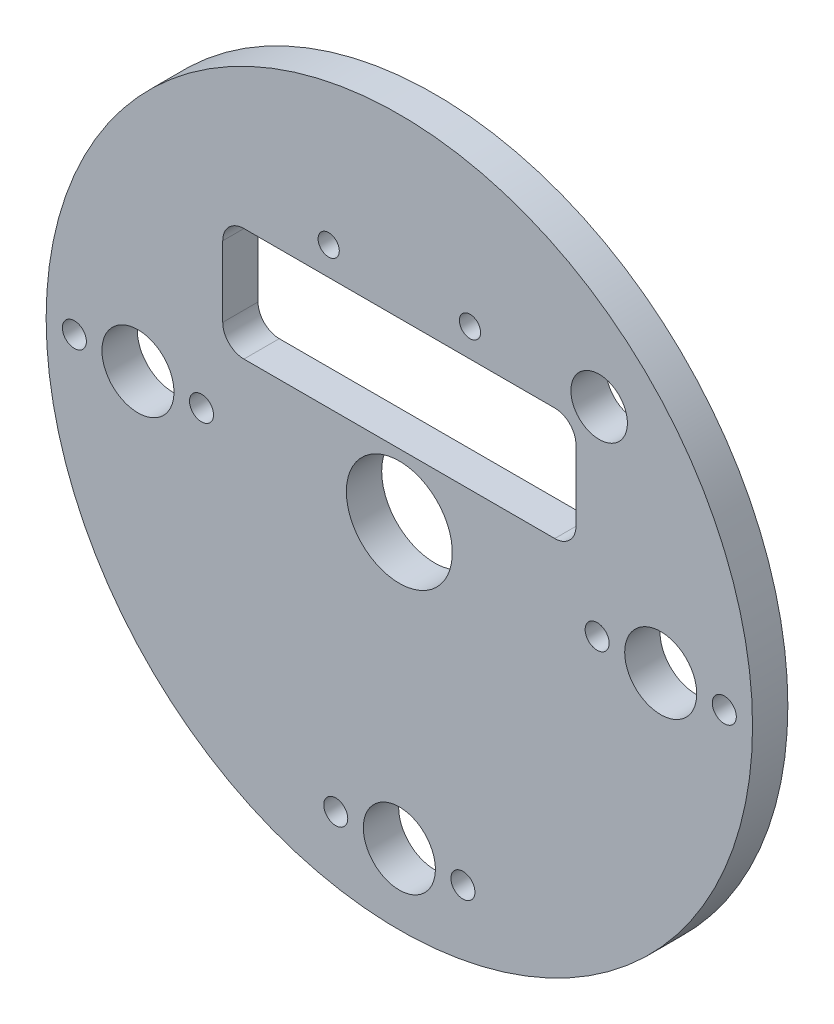
ISO-10303-21;
HEADER;
FILE_DESCRIPTION(('STEP AP214'),'2;1');
FILE_NAME('part.step','',(''),(''),'','','');
FILE_SCHEMA(('AUTOMOTIVE_DESIGN { 1 0 10303 214 1 1 1 1 }'));
ENDSEC;
DATA;
#1=APPLICATION_CONTEXT('core data for automotive mechanical design processes');
#2=APPLICATION_PROTOCOL_DEFINITION('international standard','automotive_design',2000,#1);
#3=PRODUCT_CONTEXT('',#1,'mechanical');
#4=PRODUCT('Part','Part','',(#3));
#5=PRODUCT_RELATED_PRODUCT_CATEGORY('part','',(#4));
#6=PRODUCT_DEFINITION_FORMATION('','',#4);
#7=PRODUCT_DEFINITION_CONTEXT('part definition',#1,'design');
#8=PRODUCT_DEFINITION('design','',#6,#7);
#9=PRODUCT_DEFINITION_SHAPE('','',#8);
#10=(LENGTH_UNIT() NAMED_UNIT(*) SI_UNIT(.MILLI.,.METRE.));
#11=(NAMED_UNIT(*) PLANE_ANGLE_UNIT() SI_UNIT($,.RADIAN.));
#12=(NAMED_UNIT(*) SI_UNIT($,.STERADIAN.) SOLID_ANGLE_UNIT());
#13=UNCERTAINTY_MEASURE_WITH_UNIT(LENGTH_MEASURE(1.E-05),#10,'distance_accuracy_value','');
#14=(GEOMETRIC_REPRESENTATION_CONTEXT(3) GLOBAL_UNCERTAINTY_ASSIGNED_CONTEXT((#13)) GLOBAL_UNIT_ASSIGNED_CONTEXT((#10,
#11,#12)) REPRESENTATION_CONTEXT('',''));
#15=CARTESIAN_POINT('',(0.,0.,0.));
#16=DIRECTION('',(0.,0.,1.));
#17=DIRECTION('',(1.,0.,0.));
#18=AXIS2_PLACEMENT_3D('',#15,#16,#17);
#19=CARTESIAN_POINT('',(0.,0.,5.));
#20=DIRECTION('',(0.,0.,-1.));
#21=DIRECTION('',(-1.,0.,0.));
#22=AXIS2_PLACEMENT_3D('',#19,#20,#21);
#23=CYLINDRICAL_SURFACE('',#22,50.);
#24=CARTESIAN_POINT('',(0.,0.,5.));
#25=DIRECTION('',(0.,0.,1.));
#26=DIRECTION('',(1.,0.,0.));
#27=AXIS2_PLACEMENT_3D('',#24,#25,#26);
#28=CIRCLE('',#27,50.);
#29=CARTESIAN_POINT('',(50.,0.,5.));
#30=VERTEX_POINT('',#29);
#31=EDGE_CURVE('E211',#30,#30,#28,.T.);
#32=ORIENTED_EDGE('',*,*,#31,.F.);
#33=EDGE_LOOP('',(#32));
#34=FACE_BOUND('',#33,.T.);
#35=CARTESIAN_POINT('',(0.,0.,0.));
#36=DIRECTION('',(0.,0.,1.));
#37=DIRECTION('',(1.,0.,0.));
#38=AXIS2_PLACEMENT_3D('',#35,#36,#37);
#39=CIRCLE('',#38,50.);
#40=CARTESIAN_POINT('',(50.,0.,0.));
#41=VERTEX_POINT('',#40);
#42=EDGE_CURVE('E210',#41,#41,#39,.T.);
#43=ORIENTED_EDGE('',*,*,#42,.T.);
#44=EDGE_LOOP('',(#43));
#45=FACE_BOUND('',#44,.T.);
#46=ADVANCED_FACE('F35',(#34,#45),#23,.T.);
#47=CARTESIAN_POINT('',(0.,0.,5.));
#48=DIRECTION('',(0.,0.,1.));
#49=DIRECTION('',(1.,0.,0.));
#50=AXIS2_PLACEMENT_3D('',#47,#48,#49);
#51=PLANE('',#50);
#52=CARTESIAN_POINT('',(28.2842712474618,28.284271247462,5.));
#53=DIRECTION('',(0.,0.,1.));
#54=DIRECTION('',(1.,0.,0.));
#55=AXIS2_PLACEMENT_3D('',#52,#53,#54);
#56=CIRCLE('',#55,4.00000000000002);
#57=CARTESIAN_POINT('',(32.2842712474619,28.284271247462,5.));
#58=VERTEX_POINT('',#57);
#59=EDGE_CURVE('E246',#58,#58,#56,.T.);
#60=ORIENTED_EDGE('',*,*,#59,.F.);
#61=EDGE_LOOP('',(#60));
#62=FACE_BOUND('',#61,.T.);
#63=CARTESIAN_POINT('',(-10.,29.,5.));
#64=DIRECTION('',(0.,0.,1.));
#65=DIRECTION('',(1.,0.,0.));
#66=AXIS2_PLACEMENT_3D('',#63,#64,#65);
#67=CIRCLE('',#66,1.5);
#68=CARTESIAN_POINT('',(-8.5,29.,5.));
#69=VERTEX_POINT('',#68);
#70=EDGE_CURVE('E236',#69,#69,#67,.T.);
#71=ORIENTED_EDGE('',*,*,#70,.F.);
#72=EDGE_LOOP('',(#71));
#73=FACE_BOUND('',#72,.T.);
#74=CARTESIAN_POINT('',(10.,29.,5.));
#75=DIRECTION('',(0.,0.,1.));
#76=DIRECTION('',(1.,0.,0.));
#77=AXIS2_PLACEMENT_3D('',#74,#75,#76);
#78=CIRCLE('',#77,1.5);
#79=CARTESIAN_POINT('',(11.5,29.,5.));
#80=VERTEX_POINT('',#79);
#81=EDGE_CURVE('E241',#80,#80,#78,.T.);
#82=ORIENTED_EDGE('',*,*,#81,.F.);
#83=EDGE_LOOP('',(#82));
#84=FACE_BOUND('',#83,.T.);
#85=CARTESIAN_POINT('',(-22.,12.,5.));
#86=DIRECTION('',(0.,0.,1.));
#87=DIRECTION('',(1.,0.,0.));
#88=AXIS2_PLACEMENT_3D('',#85,#86,#87);
#89=CIRCLE('',#88,3.);
#90=CARTESIAN_POINT('',(-25.,12.,5.));
#91=VERTEX_POINT('',#90);
#92=CARTESIAN_POINT('',(-22.,9.,5.));
#93=VERTEX_POINT('',#92);
#94=EDGE_CURVE('E51',#91,#93,#89,.T.);
#95=ORIENTED_EDGE('',*,*,#94,.F.);
#96=DIRECTION('',(0.,-1.,0.));
#97=VECTOR('',#96,1.);
#98=CARTESIAN_POINT('',(-25.,22.,5.));
#99=LINE('',#98,#97);
#100=CARTESIAN_POINT('',(-25.,22.,5.));
#101=VERTEX_POINT('',#100);
#102=EDGE_CURVE('E135',#101,#91,#99,.T.);
#103=ORIENTED_EDGE('',*,*,#102,.F.);
#104=CARTESIAN_POINT('',(-22.,22.,5.));
#105=DIRECTION('',(0.,0.,1.));
#106=DIRECTION('',(-1.,0.,0.));
#107=AXIS2_PLACEMENT_3D('',#104,#105,#106);
#108=CIRCLE('',#107,3.);
#109=CARTESIAN_POINT('',(-22.,25.,5.));
#110=VERTEX_POINT('',#109);
#111=EDGE_CURVE('E132',#110,#101,#108,.T.);
#112=ORIENTED_EDGE('',*,*,#111,.F.);
#113=DIRECTION('',(-1.,0.,0.));
#114=VECTOR('',#113,1.);
#115=CARTESIAN_POINT('',(-22.,25.,5.));
#116=LINE('',#115,#114);
#117=CARTESIAN_POINT('',(22.,25.,5.));
#118=VERTEX_POINT('',#117);
#119=EDGE_CURVE('E129',#118,#110,#116,.T.);
#120=ORIENTED_EDGE('',*,*,#119,.F.);
#121=CARTESIAN_POINT('',(22.,22.,5.));
#122=DIRECTION('',(0.,0.,1.));
#123=DIRECTION('',(1.,0.,0.));
#124=AXIS2_PLACEMENT_3D('',#121,#122,#123);
#125=CIRCLE('',#124,3.);
#126=CARTESIAN_POINT('',(25.,22.,5.));
#127=VERTEX_POINT('',#126);
#128=EDGE_CURVE('E123',#127,#118,#125,.T.);
#129=ORIENTED_EDGE('',*,*,#128,.F.);
#130=DIRECTION('',(0.,1.,0.));
#131=VECTOR('',#130,1.);
#132=CARTESIAN_POINT('',(25.,22.,5.));
#133=LINE('',#132,#131);
#134=CARTESIAN_POINT('',(25.,12.,5.));
#135=VERTEX_POINT('',#134);
#136=EDGE_CURVE('E121',#135,#127,#133,.T.);
#137=ORIENTED_EDGE('',*,*,#136,.F.);
#138=CARTESIAN_POINT('',(22.,12.,5.));
#139=DIRECTION('',(0.,0.,1.));
#140=DIRECTION('',(-1.,0.,0.));
#141=AXIS2_PLACEMENT_3D('',#138,#139,#140);
#142=CIRCLE('',#141,3.);
#143=CARTESIAN_POINT('',(22.,9.00000000000001,5.));
#144=VERTEX_POINT('',#143);
#145=EDGE_CURVE('E104',#144,#135,#142,.T.);
#146=ORIENTED_EDGE('',*,*,#145,.F.);
#147=DIRECTION('',(1.,0.,0.));
#148=VECTOR('',#147,1.);
#149=CARTESIAN_POINT('',(-22.,9.,5.));
#150=LINE('',#149,#148);
#151=EDGE_CURVE('E113',#93,#144,#150,.T.);
#152=ORIENTED_EDGE('',*,*,#151,.F.);
#153=EDGE_LOOP('',(#95,#103,#112,#120,#129,#137,#146,#152));
#154=FACE_BOUND('',#153,.T.);
#155=CARTESIAN_POINT('',(46.,0.,5.));
#156=DIRECTION('',(0.,0.,1.));
#157=DIRECTION('',(1.,0.,0.));
#158=AXIS2_PLACEMENT_3D('',#155,#156,#157);
#159=CIRCLE('',#158,1.7);
#160=CARTESIAN_POINT('',(47.7,0.,5.));
#161=VERTEX_POINT('',#160);
#162=EDGE_CURVE('E140',#161,#161,#159,.T.);
#163=ORIENTED_EDGE('',*,*,#162,.F.);
#164=EDGE_LOOP('',(#163));
#165=FACE_BOUND('',#164,.T.);
#166=CARTESIAN_POINT('',(28.,0.,5.));
#167=DIRECTION('',(0.,0.,1.));
#168=DIRECTION('',(1.,0.,0.));
#169=AXIS2_PLACEMENT_3D('',#166,#167,#168);
#170=CIRCLE('',#169,1.7);
#171=CARTESIAN_POINT('',(29.7,0.,5.));
#172=VERTEX_POINT('',#171);
#173=EDGE_CURVE('E156',#172,#172,#170,.T.);
#174=ORIENTED_EDGE('',*,*,#173,.F.);
#175=EDGE_LOOP('',(#174));
#176=FACE_BOUND('',#175,.T.);
#177=CARTESIAN_POINT('',(9.,-40.,5.));
#178=DIRECTION('',(0.,0.,1.));
#179=DIRECTION('',(1.,0.,0.));
#180=AXIS2_PLACEMENT_3D('',#177,#178,#179);
#181=CIRCLE('',#180,1.7);
#182=CARTESIAN_POINT('',(10.7,-40.,5.));
#183=VERTEX_POINT('',#182);
#184=EDGE_CURVE('E162',#183,#183,#181,.T.);
#185=ORIENTED_EDGE('',*,*,#184,.F.);
#186=EDGE_LOOP('',(#185));
#187=FACE_BOUND('',#186,.T.);
#188=CARTESIAN_POINT('',(-9.,-40.,5.));
#189=DIRECTION('',(0.,0.,1.));
#190=DIRECTION('',(1.,0.,0.));
#191=AXIS2_PLACEMENT_3D('',#188,#189,#190);
#192=CIRCLE('',#191,1.7);
#193=CARTESIAN_POINT('',(-7.3,-40.,5.));
#194=VERTEX_POINT('',#193);
#195=EDGE_CURVE('E168',#194,#194,#192,.T.);
#196=ORIENTED_EDGE('',*,*,#195,.F.);
#197=EDGE_LOOP('',(#196));
#198=FACE_BOUND('',#197,.T.);
#199=CARTESIAN_POINT('',(-46.,2.97129651685814E-13,5.));
#200=DIRECTION('',(0.,0.,1.));
#201=DIRECTION('',(1.,0.,0.));
#202=AXIS2_PLACEMENT_3D('',#199,#200,#201);
#203=CIRCLE('',#202,1.7);
#204=CARTESIAN_POINT('',(-44.3,2.97129651685814E-13,5.));
#205=VERTEX_POINT('',#204);
#206=EDGE_CURVE('E174',#205,#205,#203,.T.);
#207=ORIENTED_EDGE('',*,*,#206,.F.);
#208=EDGE_LOOP('',(#207));
#209=FACE_BOUND('',#208,.T.);
#210=CARTESIAN_POINT('',(-28.,-1.71810817162361E-12,5.));
#211=DIRECTION('',(0.,0.,1.));
#212=DIRECTION('',(1.,0.,0.));
#213=AXIS2_PLACEMENT_3D('',#210,#211,#212);
#214=CIRCLE('',#213,1.7);
#215=CARTESIAN_POINT('',(-26.3,-1.71810817162361E-12,5.));
#216=VERTEX_POINT('',#215);
#217=EDGE_CURVE('E180',#216,#216,#214,.T.);
#218=ORIENTED_EDGE('',*,*,#217,.F.);
#219=EDGE_LOOP('',(#218));
#220=FACE_BOUND('',#219,.T.);
#221=CARTESIAN_POINT('',(-37.,0.,5.));
#222=DIRECTION('',(0.,0.,-1.));
#223=DIRECTION('',(-1.,0.,0.));
#224=AXIS2_PLACEMENT_3D('',#221,#222,#223);
#225=CIRCLE('',#224,5.1);
#226=CARTESIAN_POINT('',(-42.1,0.,5.));
#227=VERTEX_POINT('',#226);
#228=EDGE_CURVE('E189',#227,#227,#225,.T.);
#229=ORIENTED_EDGE('',*,*,#228,.T.);
#230=EDGE_LOOP('',(#229));
#231=FACE_BOUND('',#230,.T.);
#232=CARTESIAN_POINT('',(37.,2.68166793467571E-13,5.));
#233=DIRECTION('',(0.,0.,-1.));
#234=DIRECTION('',(-1.,0.,0.));
#235=AXIS2_PLACEMENT_3D('',#232,#233,#234);
#236=CIRCLE('',#235,5.1);
#237=CARTESIAN_POINT('',(31.9,2.68166793467571E-13,5.));
#238=VERTEX_POINT('',#237);
#239=EDGE_CURVE('E195',#238,#238,#236,.T.);
#240=ORIENTED_EDGE('',*,*,#239,.T.);
#241=EDGE_LOOP('',(#240));
#242=FACE_BOUND('',#241,.T.);
#243=CARTESIAN_POINT('',(0.,-40.,5.));
#244=DIRECTION('',(0.,0.,-1.));
#245=DIRECTION('',(-1.,0.,0.));
#246=AXIS2_PLACEMENT_3D('',#243,#244,#245);
#247=CIRCLE('',#246,5.1);
#248=CARTESIAN_POINT('',(-5.1,-40.,5.));
#249=VERTEX_POINT('',#248);
#250=EDGE_CURVE('E201',#249,#249,#247,.T.);
#251=ORIENTED_EDGE('',*,*,#250,.T.);
#252=EDGE_LOOP('',(#251));
#253=FACE_BOUND('',#252,.T.);
#254=CARTESIAN_POINT('',(0.,0.,5.));
#255=DIRECTION('',(0.,0.,-1.));
#256=DIRECTION('',(-1.,0.,0.));
#257=AXIS2_PLACEMENT_3D('',#254,#255,#256);
#258=CIRCLE('',#257,7.5);
#259=CARTESIAN_POINT('',(-7.5,0.,5.));
#260=VERTEX_POINT('',#259);
#261=EDGE_CURVE('E207',#260,#260,#258,.T.);
#262=ORIENTED_EDGE('',*,*,#261,.T.);
#263=EDGE_LOOP('',(#262));
#264=FACE_BOUND('',#263,.T.);
#265=ORIENTED_EDGE('',*,*,#31,.T.);
#266=EDGE_LOOP('',(#265));
#267=FACE_BOUND('',#266,.T.);
#268=ADVANCED_FACE('F117',(#62,#73,#84,#154,#165,#176,#187,#198,#209,#220,#231,#242,#253,#264,
#267),#51,.T.);
#269=CARTESIAN_POINT('',(0.,0.,0.));
#270=DIRECTION('',(0.,0.,1.));
#271=DIRECTION('',(1.,0.,0.));
#272=AXIS2_PLACEMENT_3D('',#269,#270,#271);
#273=PLANE('',#272);
#274=CARTESIAN_POINT('',(28.2842712474618,28.284271247462,0.));
#275=DIRECTION('',(0.,0.,1.));
#276=DIRECTION('',(1.,0.,0.));
#277=AXIS2_PLACEMENT_3D('',#274,#275,#276);
#278=CIRCLE('',#277,4.00000000000002);
#279=CARTESIAN_POINT('',(32.2842712474619,28.284271247462,0.));
#280=VERTEX_POINT('',#279);
#281=EDGE_CURVE('E38',#280,#280,#278,.T.);
#282=ORIENTED_EDGE('',*,*,#281,.T.);
#283=EDGE_LOOP('',(#282));
#284=FACE_BOUND('',#283,.T.);
#285=CARTESIAN_POINT('',(-10.,29.,0.));
#286=DIRECTION('',(0.,0.,1.));
#287=DIRECTION('',(1.,0.,0.));
#288=AXIS2_PLACEMENT_3D('',#285,#286,#287);
#289=CIRCLE('',#288,1.5);
#290=CARTESIAN_POINT('',(-8.5,29.,0.));
#291=VERTEX_POINT('',#290);
#292=EDGE_CURVE('E235',#291,#291,#289,.T.);
#293=ORIENTED_EDGE('',*,*,#292,.T.);
#294=EDGE_LOOP('',(#293));
#295=FACE_BOUND('',#294,.T.);
#296=CARTESIAN_POINT('',(10.,29.,0.));
#297=DIRECTION('',(0.,0.,1.));
#298=DIRECTION('',(1.,0.,0.));
#299=AXIS2_PLACEMENT_3D('',#296,#297,#298);
#300=CIRCLE('',#299,1.5);
#301=CARTESIAN_POINT('',(11.5,29.,0.));
#302=VERTEX_POINT('',#301);
#303=EDGE_CURVE('E233',#302,#302,#300,.T.);
#304=ORIENTED_EDGE('',*,*,#303,.T.);
#305=EDGE_LOOP('',(#304));
#306=FACE_BOUND('',#305,.T.);
#307=DIRECTION('',(0.,-1.,0.));
#308=VECTOR('',#307,1.);
#309=CARTESIAN_POINT('',(-25.,0.,0.));
#310=LINE('',#309,#308);
#311=CARTESIAN_POINT('',(-25.,22.,0.));
#312=VERTEX_POINT('',#311);
#313=CARTESIAN_POINT('',(-25.,12.,0.));
#314=VERTEX_POINT('',#313);
#315=EDGE_CURVE('E43',#312,#314,#310,.T.);
#316=ORIENTED_EDGE('',*,*,#315,.T.);
#317=CARTESIAN_POINT('',(-22.,12.,0.));
#318=DIRECTION('',(0.,0.,1.));
#319=DIRECTION('',(1.,0.,0.));
#320=AXIS2_PLACEMENT_3D('',#317,#318,#319);
#321=CIRCLE('',#320,3.);
#322=CARTESIAN_POINT('',(-22.,9.,0.));
#323=VERTEX_POINT('',#322);
#324=EDGE_CURVE('E11',#314,#323,#321,.T.);
#325=ORIENTED_EDGE('',*,*,#324,.T.);
#326=DIRECTION('',(1.,0.,0.));
#327=VECTOR('',#326,1.);
#328=CARTESIAN_POINT('',(0.,9.,0.));
#329=LINE('',#328,#327);
#330=CARTESIAN_POINT('',(22.,9.,0.));
#331=VERTEX_POINT('',#330);
#332=EDGE_CURVE('E214',#323,#331,#329,.T.);
#333=ORIENTED_EDGE('',*,*,#332,.T.);
#334=CARTESIAN_POINT('',(22.,12.,0.));
#335=DIRECTION('',(0.,0.,1.));
#336=DIRECTION('',(1.,0.,0.));
#337=AXIS2_PLACEMENT_3D('',#334,#335,#336);
#338=CIRCLE('',#337,3.);
#339=CARTESIAN_POINT('',(25.,12.,0.));
#340=VERTEX_POINT('',#339);
#341=EDGE_CURVE('E107',#331,#340,#338,.T.);
#342=ORIENTED_EDGE('',*,*,#341,.T.);
#343=DIRECTION('',(0.,1.,0.));
#344=VECTOR('',#343,1.);
#345=CARTESIAN_POINT('',(25.,0.,0.));
#346=LINE('',#345,#344);
#347=CARTESIAN_POINT('',(25.,22.,0.));
#348=VERTEX_POINT('',#347);
#349=EDGE_CURVE('E219',#340,#348,#346,.T.);
#350=ORIENTED_EDGE('',*,*,#349,.T.);
#351=CARTESIAN_POINT('',(22.,22.,0.));
#352=DIRECTION('',(0.,0.,1.));
#353=DIRECTION('',(1.,0.,0.));
#354=AXIS2_PLACEMENT_3D('',#351,#352,#353);
#355=CIRCLE('',#354,3.);
#356=CARTESIAN_POINT('',(22.,25.,0.));
#357=VERTEX_POINT('',#356);
#358=EDGE_CURVE('E222',#348,#357,#355,.T.);
#359=ORIENTED_EDGE('',*,*,#358,.T.);
#360=DIRECTION('',(-1.,0.,0.));
#361=VECTOR('',#360,1.);
#362=CARTESIAN_POINT('',(0.,25.,0.));
#363=LINE('',#362,#361);
#364=CARTESIAN_POINT('',(-22.,25.,0.));
#365=VERTEX_POINT('',#364);
#366=EDGE_CURVE('E225',#357,#365,#363,.T.);
#367=ORIENTED_EDGE('',*,*,#366,.T.);
#368=CARTESIAN_POINT('',(-22.,22.,0.));
#369=DIRECTION('',(0.,0.,1.));
#370=DIRECTION('',(1.,0.,0.));
#371=AXIS2_PLACEMENT_3D('',#368,#369,#370);
#372=CIRCLE('',#371,3.);
#373=EDGE_CURVE('E228',#365,#312,#372,.T.);
#374=ORIENTED_EDGE('',*,*,#373,.T.);
#375=EDGE_LOOP('',(#316,#325,#333,#342,#350,#359,#367,#374));
#376=FACE_BOUND('',#375,.T.);
#377=CARTESIAN_POINT('',(46.,0.,0.));
#378=DIRECTION('',(0.,0.,1.));
#379=DIRECTION('',(1.,0.,0.));
#380=AXIS2_PLACEMENT_3D('',#377,#378,#379);
#381=CIRCLE('',#380,1.7);
#382=CARTESIAN_POINT('',(47.7,0.,0.));
#383=VERTEX_POINT('',#382);
#384=EDGE_CURVE('E153',#383,#383,#381,.T.);
#385=ORIENTED_EDGE('',*,*,#384,.T.);
#386=EDGE_LOOP('',(#385));
#387=FACE_BOUND('',#386,.T.);
#388=CARTESIAN_POINT('',(28.,0.,0.));
#389=DIRECTION('',(0.,0.,1.));
#390=DIRECTION('',(1.,0.,0.));
#391=AXIS2_PLACEMENT_3D('',#388,#389,#390);
#392=CIRCLE('',#391,1.7);
#393=CARTESIAN_POINT('',(29.7,0.,0.));
#394=VERTEX_POINT('',#393);
#395=EDGE_CURVE('E159',#394,#394,#392,.T.);
#396=ORIENTED_EDGE('',*,*,#395,.T.);
#397=EDGE_LOOP('',(#396));
#398=FACE_BOUND('',#397,.T.);
#399=CARTESIAN_POINT('',(9.,-40.,0.));
#400=DIRECTION('',(0.,0.,1.));
#401=DIRECTION('',(1.,0.,0.));
#402=AXIS2_PLACEMENT_3D('',#399,#400,#401);
#403=CIRCLE('',#402,1.7);
#404=CARTESIAN_POINT('',(10.7,-40.,0.));
#405=VERTEX_POINT('',#404);
#406=EDGE_CURVE('E165',#405,#405,#403,.T.);
#407=ORIENTED_EDGE('',*,*,#406,.T.);
#408=EDGE_LOOP('',(#407));
#409=FACE_BOUND('',#408,.T.);
#410=CARTESIAN_POINT('',(-9.,-40.,0.));
#411=DIRECTION('',(0.,0.,1.));
#412=DIRECTION('',(1.,0.,0.));
#413=AXIS2_PLACEMENT_3D('',#410,#411,#412);
#414=CIRCLE('',#413,1.7);
#415=CARTESIAN_POINT('',(-7.3,-40.,0.));
#416=VERTEX_POINT('',#415);
#417=EDGE_CURVE('E171',#416,#416,#414,.T.);
#418=ORIENTED_EDGE('',*,*,#417,.T.);
#419=EDGE_LOOP('',(#418));
#420=FACE_BOUND('',#419,.T.);
#421=CARTESIAN_POINT('',(-46.,2.97129651685814E-13,0.));
#422=DIRECTION('',(0.,0.,1.));
#423=DIRECTION('',(1.,0.,0.));
#424=AXIS2_PLACEMENT_3D('',#421,#422,#423);
#425=CIRCLE('',#424,1.7);
#426=CARTESIAN_POINT('',(-44.3,2.97129651685814E-13,0.));
#427=VERTEX_POINT('',#426);
#428=EDGE_CURVE('E177',#427,#427,#425,.T.);
#429=ORIENTED_EDGE('',*,*,#428,.T.);
#430=EDGE_LOOP('',(#429));
#431=FACE_BOUND('',#430,.T.);
#432=CARTESIAN_POINT('',(-28.,-1.71810817162361E-12,0.));
#433=DIRECTION('',(0.,0.,1.));
#434=DIRECTION('',(1.,0.,0.));
#435=AXIS2_PLACEMENT_3D('',#432,#433,#434);
#436=CIRCLE('',#435,1.7);
#437=CARTESIAN_POINT('',(-26.3,-1.71810817162361E-12,0.));
#438=VERTEX_POINT('',#437);
#439=EDGE_CURVE('E183',#438,#438,#436,.T.);
#440=ORIENTED_EDGE('',*,*,#439,.T.);
#441=EDGE_LOOP('',(#440));
#442=FACE_BOUND('',#441,.T.);
#443=CARTESIAN_POINT('',(-37.,0.,0.));
#444=DIRECTION('',(0.,0.,-1.));
#445=DIRECTION('',(-1.,0.,0.));
#446=AXIS2_PLACEMENT_3D('',#443,#444,#445);
#447=CIRCLE('',#446,5.1);
#448=CARTESIAN_POINT('',(-42.1,0.,0.));
#449=VERTEX_POINT('',#448);
#450=EDGE_CURVE('E186',#449,#449,#447,.T.);
#451=ORIENTED_EDGE('',*,*,#450,.F.);
#452=EDGE_LOOP('',(#451));
#453=FACE_BOUND('',#452,.T.);
#454=CARTESIAN_POINT('',(37.,2.68166793467571E-13,0.));
#455=DIRECTION('',(0.,0.,-1.));
#456=DIRECTION('',(-1.,0.,0.));
#457=AXIS2_PLACEMENT_3D('',#454,#455,#456);
#458=CIRCLE('',#457,5.1);
#459=CARTESIAN_POINT('',(31.9,2.68166793467571E-13,0.));
#460=VERTEX_POINT('',#459);
#461=EDGE_CURVE('E192',#460,#460,#458,.T.);
#462=ORIENTED_EDGE('',*,*,#461,.F.);
#463=EDGE_LOOP('',(#462));
#464=FACE_BOUND('',#463,.T.);
#465=CARTESIAN_POINT('',(0.,-40.,0.));
#466=DIRECTION('',(0.,0.,-1.));
#467=DIRECTION('',(-1.,0.,0.));
#468=AXIS2_PLACEMENT_3D('',#465,#466,#467);
#469=CIRCLE('',#468,5.1);
#470=CARTESIAN_POINT('',(-5.1,-40.,0.));
#471=VERTEX_POINT('',#470);
#472=EDGE_CURVE('E198',#471,#471,#469,.T.);
#473=ORIENTED_EDGE('',*,*,#472,.F.);
#474=EDGE_LOOP('',(#473));
#475=FACE_BOUND('',#474,.T.);
#476=CARTESIAN_POINT('',(0.,0.,0.));
#477=DIRECTION('',(0.,0.,-1.));
#478=DIRECTION('',(-1.,0.,0.));
#479=AXIS2_PLACEMENT_3D('',#476,#477,#478);
#480=CIRCLE('',#479,7.5);
#481=CARTESIAN_POINT('',(-7.5,0.,0.));
#482=VERTEX_POINT('',#481);
#483=EDGE_CURVE('E204',#482,#482,#480,.T.);
#484=ORIENTED_EDGE('',*,*,#483,.F.);
#485=EDGE_LOOP('',(#484));
#486=FACE_BOUND('',#485,.T.);
#487=ORIENTED_EDGE('',*,*,#42,.F.);
#488=EDGE_LOOP('',(#487));
#489=FACE_BOUND('',#488,.T.);
#490=ADVANCED_FACE('F253',(#284,#295,#306,#376,#387,#398,#409,#420,#431,#442,#453,#464,#475,
#486,#489),#273,.F.);
#491=CARTESIAN_POINT('',(0.,0.,0.));
#492=DIRECTION('',(0.,0.,-1.));
#493=DIRECTION('',(-1.,0.,0.));
#494=AXIS2_PLACEMENT_3D('',#491,#492,#493);
#495=CYLINDRICAL_SURFACE('',#494,7.5);
#496=ORIENTED_EDGE('',*,*,#261,.F.);
#497=EDGE_LOOP('',(#496));
#498=FACE_BOUND('',#497,.T.);
#499=ORIENTED_EDGE('',*,*,#483,.T.);
#500=EDGE_LOOP('',(#499));
#501=FACE_BOUND('',#500,.T.);
#502=ADVANCED_FACE('F277',(#498,#501),#495,.F.);
#503=CARTESIAN_POINT('',(0.,-40.,0.));
#504=DIRECTION('',(0.,0.,-1.));
#505=DIRECTION('',(-1.,0.,0.));
#506=AXIS2_PLACEMENT_3D('',#503,#504,#505);
#507=CYLINDRICAL_SURFACE('',#506,5.1);
#508=ORIENTED_EDGE('',*,*,#250,.F.);
#509=EDGE_LOOP('',(#508));
#510=FACE_BOUND('',#509,.T.);
#511=ORIENTED_EDGE('',*,*,#472,.T.);
#512=EDGE_LOOP('',(#511));
#513=FACE_BOUND('',#512,.T.);
#514=ADVANCED_FACE('F281',(#510,#513),#507,.F.);
#515=CARTESIAN_POINT('',(37.,2.68166793467571E-13,0.));
#516=DIRECTION('',(0.,0.,-1.));
#517=DIRECTION('',(-1.,0.,0.));
#518=AXIS2_PLACEMENT_3D('',#515,#516,#517);
#519=CYLINDRICAL_SURFACE('',#518,5.1);
#520=ORIENTED_EDGE('',*,*,#239,.F.);
#521=EDGE_LOOP('',(#520));
#522=FACE_BOUND('',#521,.T.);
#523=ORIENTED_EDGE('',*,*,#461,.T.);
#524=EDGE_LOOP('',(#523));
#525=FACE_BOUND('',#524,.T.);
#526=ADVANCED_FACE('F287',(#522,#525),#519,.F.);
#527=CARTESIAN_POINT('',(-37.,0.,0.));
#528=DIRECTION('',(0.,0.,-1.));
#529=DIRECTION('',(-1.,0.,0.));
#530=AXIS2_PLACEMENT_3D('',#527,#528,#529);
#531=CYLINDRICAL_SURFACE('',#530,5.1);
#532=ORIENTED_EDGE('',*,*,#228,.F.);
#533=EDGE_LOOP('',(#532));
#534=FACE_BOUND('',#533,.T.);
#535=ORIENTED_EDGE('',*,*,#450,.T.);
#536=EDGE_LOOP('',(#535));
#537=FACE_BOUND('',#536,.T.);
#538=ADVANCED_FACE('F291',(#534,#537),#531,.F.);
#539=CARTESIAN_POINT('',(-28.,-1.71810817162361E-12,5.));
#540=DIRECTION('',(0.,0.,1.));
#541=DIRECTION('',(1.,0.,0.));
#542=AXIS2_PLACEMENT_3D('',#539,#540,#541);
#543=CYLINDRICAL_SURFACE('',#542,1.7);
#544=ORIENTED_EDGE('',*,*,#439,.F.);
#545=EDGE_LOOP('',(#544));
#546=FACE_BOUND('',#545,.T.);
#547=ORIENTED_EDGE('',*,*,#217,.T.);
#548=EDGE_LOOP('',(#547));
#549=FACE_BOUND('',#548,.T.);
#550=ADVANCED_FACE('F295',(#546,#549),#543,.F.);
#551=CARTESIAN_POINT('',(-46.,2.97129651685814E-13,5.));
#552=DIRECTION('',(0.,0.,1.));
#553=DIRECTION('',(1.,0.,0.));
#554=AXIS2_PLACEMENT_3D('',#551,#552,#553);
#555=CYLINDRICAL_SURFACE('',#554,1.7);
#556=ORIENTED_EDGE('',*,*,#428,.F.);
#557=EDGE_LOOP('',(#556));
#558=FACE_BOUND('',#557,.T.);
#559=ORIENTED_EDGE('',*,*,#206,.T.);
#560=EDGE_LOOP('',(#559));
#561=FACE_BOUND('',#560,.T.);
#562=ADVANCED_FACE('F299',(#558,#561),#555,.F.);
#563=CARTESIAN_POINT('',(-9.,-40.,5.));
#564=DIRECTION('',(0.,0.,1.));
#565=DIRECTION('',(1.,0.,0.));
#566=AXIS2_PLACEMENT_3D('',#563,#564,#565);
#567=CYLINDRICAL_SURFACE('',#566,1.7);
#568=ORIENTED_EDGE('',*,*,#417,.F.);
#569=EDGE_LOOP('',(#568));
#570=FACE_BOUND('',#569,.T.);
#571=ORIENTED_EDGE('',*,*,#195,.T.);
#572=EDGE_LOOP('',(#571));
#573=FACE_BOUND('',#572,.T.);
#574=ADVANCED_FACE('F303',(#570,#573),#567,.F.);
#575=CARTESIAN_POINT('',(9.,-40.,5.));
#576=DIRECTION('',(0.,0.,1.));
#577=DIRECTION('',(1.,0.,0.));
#578=AXIS2_PLACEMENT_3D('',#575,#576,#577);
#579=CYLINDRICAL_SURFACE('',#578,1.7);
#580=ORIENTED_EDGE('',*,*,#406,.F.);
#581=EDGE_LOOP('',(#580));
#582=FACE_BOUND('',#581,.T.);
#583=ORIENTED_EDGE('',*,*,#184,.T.);
#584=EDGE_LOOP('',(#583));
#585=FACE_BOUND('',#584,.T.);
#586=ADVANCED_FACE('F307',(#582,#585),#579,.F.);
#587=CARTESIAN_POINT('',(28.,0.,5.));
#588=DIRECTION('',(0.,0.,1.));
#589=DIRECTION('',(1.,0.,0.));
#590=AXIS2_PLACEMENT_3D('',#587,#588,#589);
#591=CYLINDRICAL_SURFACE('',#590,1.7);
#592=ORIENTED_EDGE('',*,*,#395,.F.);
#593=EDGE_LOOP('',(#592));
#594=FACE_BOUND('',#593,.T.);
#595=ORIENTED_EDGE('',*,*,#173,.T.);
#596=EDGE_LOOP('',(#595));
#597=FACE_BOUND('',#596,.T.);
#598=ADVANCED_FACE('F311',(#594,#597),#591,.F.);
#599=CARTESIAN_POINT('',(46.,0.,5.));
#600=DIRECTION('',(0.,0.,1.));
#601=DIRECTION('',(1.,0.,0.));
#602=AXIS2_PLACEMENT_3D('',#599,#600,#601);
#603=CYLINDRICAL_SURFACE('',#602,1.7);
#604=ORIENTED_EDGE('',*,*,#384,.F.);
#605=EDGE_LOOP('',(#604));
#606=FACE_BOUND('',#605,.T.);
#607=ORIENTED_EDGE('',*,*,#162,.T.);
#608=EDGE_LOOP('',(#607));
#609=FACE_BOUND('',#608,.T.);
#610=ADVANCED_FACE('F315',(#606,#609),#603,.F.);
#611=CARTESIAN_POINT('',(-22.,12.,-5.));
#612=DIRECTION('',(0.,0.,1.));
#613=DIRECTION('',(1.,0.,0.));
#614=AXIS2_PLACEMENT_3D('',#611,#612,#613);
#615=CYLINDRICAL_SURFACE('',#614,3.);
#616=DIRECTION('',(0.,0.,1.));
#617=VECTOR('',#616,1.);
#618=CARTESIAN_POINT('',(-25.,12.,-5.));
#619=LINE('',#618,#617);
#620=EDGE_CURVE('E138',#314,#91,#619,.T.);
#621=ORIENTED_EDGE('',*,*,#620,.T.);
#622=ORIENTED_EDGE('',*,*,#94,.T.);
#623=DIRECTION('',(0.,0.,1.));
#624=VECTOR('',#623,1.);
#625=CARTESIAN_POINT('',(-22.,9.,-5.));
#626=LINE('',#625,#624);
#627=EDGE_CURVE('E110',#323,#93,#626,.T.);
#628=ORIENTED_EDGE('',*,*,#627,.F.);
#629=ORIENTED_EDGE('',*,*,#324,.F.);
#630=EDGE_LOOP('',(#621,#622,#628,#629));
#631=FACE_BOUND('',#630,.T.);
#632=ADVANCED_FACE('F319',(#631),#615,.F.);
#633=CARTESIAN_POINT('',(-25.,22.,-5.));
#634=DIRECTION('',(-1.,0.,0.));
#635=DIRECTION('',(0.,-1.,0.));
#636=AXIS2_PLACEMENT_3D('',#633,#634,#635);
#637=PLANE('',#636);
#638=DIRECTION('',(0.,0.,1.));
#639=VECTOR('',#638,1.);
#640=CARTESIAN_POINT('',(-25.,22.,-5.));
#641=LINE('',#640,#639);
#642=EDGE_CURVE('E141',#312,#101,#641,.T.);
#643=ORIENTED_EDGE('',*,*,#642,.T.);
#644=ORIENTED_EDGE('',*,*,#102,.T.);
#645=ORIENTED_EDGE('',*,*,#620,.F.);
#646=ORIENTED_EDGE('',*,*,#315,.F.);
#647=EDGE_LOOP('',(#643,#644,#645,#646));
#648=FACE_BOUND('',#647,.T.);
#649=ADVANCED_FACE('F323',(#648),#637,.F.);
#650=CARTESIAN_POINT('',(-22.,22.,-5.));
#651=DIRECTION('',(0.,0.,1.));
#652=DIRECTION('',(1.,0.,0.));
#653=AXIS2_PLACEMENT_3D('',#650,#651,#652);
#654=CYLINDRICAL_SURFACE('',#653,3.);
#655=DIRECTION('',(0.,0.,1.));
#656=VECTOR('',#655,1.);
#657=CARTESIAN_POINT('',(-22.,25.,-5.));
#658=LINE('',#657,#656);
#659=EDGE_CURVE('E143',#365,#110,#658,.T.);
#660=ORIENTED_EDGE('',*,*,#659,.T.);
#661=ORIENTED_EDGE('',*,*,#111,.T.);
#662=ORIENTED_EDGE('',*,*,#642,.F.);
#663=ORIENTED_EDGE('',*,*,#373,.F.);
#664=EDGE_LOOP('',(#660,#661,#662,#663));
#665=FACE_BOUND('',#664,.T.);
#666=ADVANCED_FACE('F339',(#665),#654,.F.);
#667=CARTESIAN_POINT('',(-22.,25.,-5.));
#668=DIRECTION('',(0.,1.,0.));
#669=DIRECTION('',(0.,0.,1.));
#670=AXIS2_PLACEMENT_3D('',#667,#668,#669);
#671=PLANE('',#670);
#672=DIRECTION('',(0.,0.,1.));
#673=VECTOR('',#672,1.);
#674=CARTESIAN_POINT('',(22.,25.,-5.));
#675=LINE('',#674,#673);
#676=EDGE_CURVE('E145',#357,#118,#675,.T.);
#677=ORIENTED_EDGE('',*,*,#676,.T.);
#678=ORIENTED_EDGE('',*,*,#119,.T.);
#679=ORIENTED_EDGE('',*,*,#659,.F.);
#680=ORIENTED_EDGE('',*,*,#366,.F.);
#681=EDGE_LOOP('',(#677,#678,#679,#680));
#682=FACE_BOUND('',#681,.T.);
#683=ADVANCED_FACE('F335',(#682),#671,.F.);
#684=CARTESIAN_POINT('',(22.,22.,-5.));
#685=DIRECTION('',(0.,0.,1.));
#686=DIRECTION('',(1.,0.,0.));
#687=AXIS2_PLACEMENT_3D('',#684,#685,#686);
#688=CYLINDRICAL_SURFACE('',#687,3.);
#689=DIRECTION('',(0.,0.,1.));
#690=VECTOR('',#689,1.);
#691=CARTESIAN_POINT('',(25.,22.,-5.));
#692=LINE('',#691,#690);
#693=EDGE_CURVE('E147',#348,#127,#692,.T.);
#694=ORIENTED_EDGE('',*,*,#693,.T.);
#695=ORIENTED_EDGE('',*,*,#128,.T.);
#696=ORIENTED_EDGE('',*,*,#676,.F.);
#697=ORIENTED_EDGE('',*,*,#358,.F.);
#698=EDGE_LOOP('',(#694,#695,#696,#697));
#699=FACE_BOUND('',#698,.T.);
#700=ADVANCED_FACE('F331',(#699),#688,.F.);
#701=CARTESIAN_POINT('',(25.,22.,-5.));
#702=DIRECTION('',(1.,0.,0.));
#703=DIRECTION('',(0.,1.,0.));
#704=AXIS2_PLACEMENT_3D('',#701,#702,#703);
#705=PLANE('',#704);
#706=DIRECTION('',(0.,0.,1.));
#707=VECTOR('',#706,1.);
#708=CARTESIAN_POINT('',(25.,12.,-5.));
#709=LINE('',#708,#707);
#710=EDGE_CURVE('E109',#340,#135,#709,.T.);
#711=ORIENTED_EDGE('',*,*,#710,.T.);
#712=ORIENTED_EDGE('',*,*,#136,.T.);
#713=ORIENTED_EDGE('',*,*,#693,.F.);
#714=ORIENTED_EDGE('',*,*,#349,.F.);
#715=EDGE_LOOP('',(#711,#712,#713,#714));
#716=FACE_BOUND('',#715,.T.);
#717=ADVANCED_FACE('F328',(#716),#705,.F.);
#718=CARTESIAN_POINT('',(22.,12.,-5.));
#719=DIRECTION('',(0.,0.,1.));
#720=DIRECTION('',(1.,0.,0.));
#721=AXIS2_PLACEMENT_3D('',#718,#719,#720);
#722=CYLINDRICAL_SURFACE('',#721,3.);
#723=DIRECTION('',(0.,0.,1.));
#724=VECTOR('',#723,1.);
#725=CARTESIAN_POINT('',(22.,9.00000000000001,-5.));
#726=LINE('',#725,#724);
#727=EDGE_CURVE('E59',#331,#144,#726,.T.);
#728=ORIENTED_EDGE('',*,*,#727,.T.);
#729=ORIENTED_EDGE('',*,*,#145,.T.);
#730=ORIENTED_EDGE('',*,*,#710,.F.);
#731=ORIENTED_EDGE('',*,*,#341,.F.);
#732=EDGE_LOOP('',(#728,#729,#730,#731));
#733=FACE_BOUND('',#732,.T.);
#734=ADVANCED_FACE('F101',(#733),#722,.F.);
#735=CARTESIAN_POINT('',(-22.,9.,-5.));
#736=DIRECTION('',(0.,-1.,0.));
#737=DIRECTION('',(0.,0.,-1.));
#738=AXIS2_PLACEMENT_3D('',#735,#736,#737);
#739=PLANE('',#738);
#740=ORIENTED_EDGE('',*,*,#627,.T.);
#741=ORIENTED_EDGE('',*,*,#151,.T.);
#742=ORIENTED_EDGE('',*,*,#727,.F.);
#743=ORIENTED_EDGE('',*,*,#332,.F.);
#744=EDGE_LOOP('',(#740,#741,#742,#743));
#745=FACE_BOUND('',#744,.T.);
#746=ADVANCED_FACE('F114',(#745),#739,.F.);
#747=CARTESIAN_POINT('',(10.,29.,-5.));
#748=DIRECTION('',(0.,0.,1.));
#749=DIRECTION('',(1.,0.,0.));
#750=AXIS2_PLACEMENT_3D('',#747,#748,#749);
#751=CYLINDRICAL_SURFACE('',#750,1.5);
#752=ORIENTED_EDGE('',*,*,#81,.T.);
#753=EDGE_LOOP('',(#752));
#754=FACE_BOUND('',#753,.T.);
#755=ORIENTED_EDGE('',*,*,#303,.F.);
#756=EDGE_LOOP('',(#755));
#757=FACE_BOUND('',#756,.T.);
#758=ADVANCED_FACE('F262',(#754,#757),#751,.F.);
#759=CARTESIAN_POINT('',(-10.,29.,-5.));
#760=DIRECTION('',(0.,0.,1.));
#761=DIRECTION('',(1.,0.,0.));
#762=AXIS2_PLACEMENT_3D('',#759,#760,#761);
#763=CYLINDRICAL_SURFACE('',#762,1.5);
#764=ORIENTED_EDGE('',*,*,#70,.T.);
#765=EDGE_LOOP('',(#764));
#766=FACE_BOUND('',#765,.T.);
#767=ORIENTED_EDGE('',*,*,#292,.F.);
#768=EDGE_LOOP('',(#767));
#769=FACE_BOUND('',#768,.T.);
#770=ADVANCED_FACE('F257',(#766,#769),#763,.F.);
#771=CARTESIAN_POINT('',(28.2842712474618,28.284271247462,-5.));
#772=DIRECTION('',(0.,0.,1.));
#773=DIRECTION('',(1.,0.,0.));
#774=AXIS2_PLACEMENT_3D('',#771,#772,#773);
#775=CYLINDRICAL_SURFACE('',#774,4.00000000000002);
#776=ORIENTED_EDGE('',*,*,#59,.T.);
#777=EDGE_LOOP('',(#776));
#778=FACE_BOUND('',#777,.T.);
#779=ORIENTED_EDGE('',*,*,#281,.F.);
#780=EDGE_LOOP('',(#779));
#781=FACE_BOUND('',#780,.T.);
#782=ADVANCED_FACE('F255',(#778,#781),#775,.F.);
#783=CLOSED_SHELL('',(#46,#268,#490,#502,#514,#526,#538,#550,#562,#574,#586,#598,#610,#632,#649,
#666,#683,#700,#717,#734,#746,#758,#770,#782));
#784=MANIFOLD_SOLID_BREP('B2',#783);
#785=ADVANCED_BREP_SHAPE_REPRESENTATION('',(#18,#784),#14);
#786=SHAPE_DEFINITION_REPRESENTATION(#9,#785);
ENDSEC;
END-ISO-10303-21;
